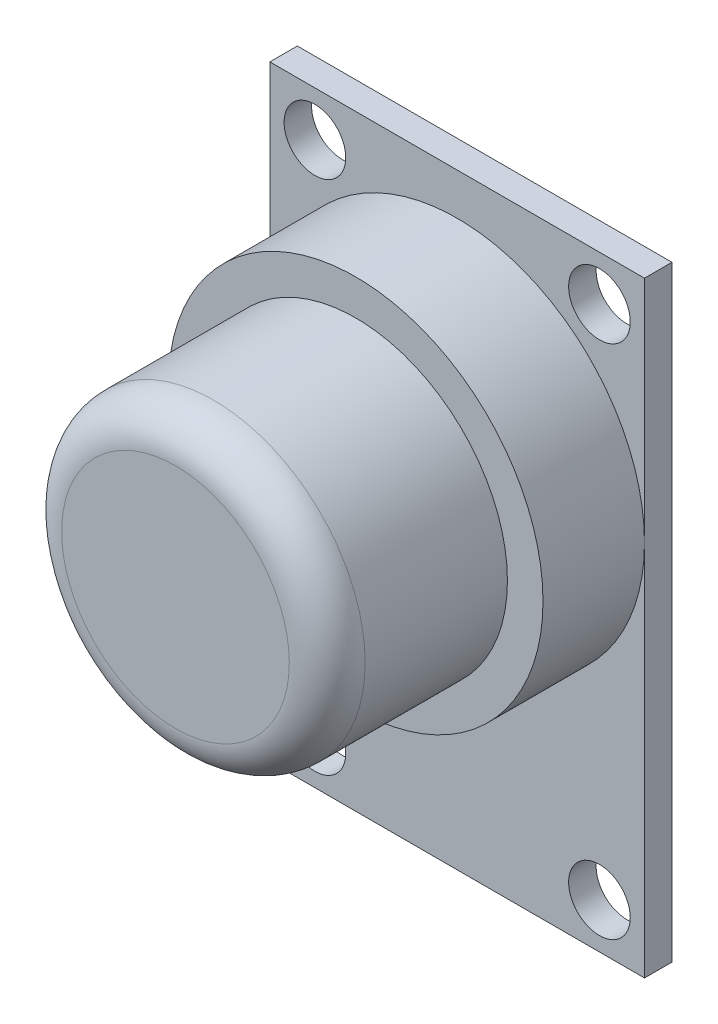
ISO-10303-21;
HEADER;
FILE_DESCRIPTION(('STEP AP214'),'2;1');
FILE_NAME('part.step','',(''),(''),'','','');
FILE_SCHEMA(('AUTOMOTIVE_DESIGN { 1 0 10303 214 1 1 1 1 }'));
ENDSEC;
DATA;
#1=APPLICATION_CONTEXT('core data for automotive mechanical design processes');
#2=APPLICATION_PROTOCOL_DEFINITION('international standard','automotive_design',2000,#1);
#3=PRODUCT_CONTEXT('',#1,'mechanical');
#4=PRODUCT('Part','Part','',(#3));
#5=PRODUCT_RELATED_PRODUCT_CATEGORY('part','',(#4));
#6=PRODUCT_DEFINITION_FORMATION('','',#4);
#7=PRODUCT_DEFINITION_CONTEXT('part definition',#1,'design');
#8=PRODUCT_DEFINITION('design','',#6,#7);
#9=PRODUCT_DEFINITION_SHAPE('','',#8);
#10=(LENGTH_UNIT() NAMED_UNIT(*) SI_UNIT(.MILLI.,.METRE.));
#11=(NAMED_UNIT(*) PLANE_ANGLE_UNIT() SI_UNIT($,.RADIAN.));
#12=(NAMED_UNIT(*) SI_UNIT($,.STERADIAN.) SOLID_ANGLE_UNIT());
#13=UNCERTAINTY_MEASURE_WITH_UNIT(LENGTH_MEASURE(1.E-05),#10,'distance_accuracy_value','');
#14=(GEOMETRIC_REPRESENTATION_CONTEXT(3) GLOBAL_UNCERTAINTY_ASSIGNED_CONTEXT((#13)) GLOBAL_UNIT_ASSIGNED_CONTEXT((#10,
#11,#12)) REPRESENTATION_CONTEXT('',''));
#15=CARTESIAN_POINT('',(0.,0.,0.));
#16=DIRECTION('',(0.,0.,1.));
#17=DIRECTION('',(1.,0.,0.));
#18=AXIS2_PLACEMENT_3D('',#15,#16,#17);
#19=CARTESIAN_POINT('',(0.,0.,1.45));
#20=DIRECTION('',(0.,0.,1.));
#21=DIRECTION('',(1.,0.,0.));
#22=AXIS2_PLACEMENT_3D('',#19,#20,#21);
#23=PLANE('',#22);
#24=CARTESIAN_POINT('',(0.,3.9,1.45));
#25=DIRECTION('',(0.,0.,1.));
#26=DIRECTION('',(1.,0.,0.));
#27=AXIS2_PLACEMENT_3D('',#24,#25,#26);
#28=CIRCLE('',#27,9.875);
#29=CARTESIAN_POINT('',(9.875,3.9,1.45));
#30=VERTEX_POINT('',#29);
#31=CARTESIAN_POINT('',(-9.875,3.9,1.45));
#32=VERTEX_POINT('',#31);
#33=EDGE_CURVE('E114',#30,#32,#28,.T.);
#34=ORIENTED_EDGE('',*,*,#33,.F.);
#35=DIRECTION('',(0.,1.,0.));
#36=VECTOR('',#35,1.);
#37=CARTESIAN_POINT('',(9.875,15.975,1.45));
#38=LINE('',#37,#36);
#39=CARTESIAN_POINT('',(9.875,15.975,1.45));
#40=VERTEX_POINT('',#39);
#41=EDGE_CURVE('E95',#30,#40,#38,.T.);
#42=ORIENTED_EDGE('',*,*,#41,.T.);
#43=DIRECTION('',(-1.,0.,0.));
#44=VECTOR('',#43,1.);
#45=CARTESIAN_POINT('',(-9.875,15.975,1.45));
#46=LINE('',#45,#44);
#47=CARTESIAN_POINT('',(-9.875,15.975,1.45));
#48=VERTEX_POINT('',#47);
#49=EDGE_CURVE('E104',#40,#48,#46,.T.);
#50=ORIENTED_EDGE('',*,*,#49,.T.);
#51=DIRECTION('',(0.,-1.,0.));
#52=VECTOR('',#51,1.);
#53=CARTESIAN_POINT('',(-9.875,15.975,1.45));
#54=LINE('',#53,#52);
#55=EDGE_CURVE('E117',#48,#32,#54,.T.);
#56=ORIENTED_EDGE('',*,*,#55,.T.);
#57=EDGE_LOOP('',(#34,#42,#50,#56));
#58=FACE_BOUND('',#57,.T.);
#59=CARTESIAN_POINT('',(-7.5,13.6,1.45));
#60=DIRECTION('',(0.,0.,1.));
#61=DIRECTION('',(1.,0.,0.));
#62=AXIS2_PLACEMENT_3D('',#59,#60,#61);
#63=CIRCLE('',#62,1.625);
#64=CARTESIAN_POINT('',(-5.875,13.6,1.45));
#65=VERTEX_POINT('',#64);
#66=EDGE_CURVE('E137',#65,#65,#63,.T.);
#67=ORIENTED_EDGE('',*,*,#66,.F.);
#68=EDGE_LOOP('',(#67));
#69=FACE_BOUND('',#68,.T.);
#70=CARTESIAN_POINT('',(7.5,13.6,1.45));
#71=DIRECTION('',(0.,0.,1.));
#72=DIRECTION('',(-1.,0.,0.));
#73=AXIS2_PLACEMENT_3D('',#70,#71,#72);
#74=CIRCLE('',#73,1.625);
#75=CARTESIAN_POINT('',(5.875,13.6,1.45));
#76=VERTEX_POINT('',#75);
#77=EDGE_CURVE('E150',#76,#76,#74,.T.);
#78=ORIENTED_EDGE('',*,*,#77,.F.);
#79=EDGE_LOOP('',(#78));
#80=FACE_BOUND('',#79,.T.);
#81=ADVANCED_FACE('F44',(#58,#69,#80),#23,.T.);
#82=CARTESIAN_POINT('',(9.875,15.975,1.45));
#83=DIRECTION('',(-1.,0.,0.));
#84=DIRECTION('',(0.,-1.,0.));
#85=AXIS2_PLACEMENT_3D('',#82,#83,#84);
#86=PLANE('',#85);
#87=DIRECTION('',(0.,1.,0.));
#88=VECTOR('',#87,1.);
#89=CARTESIAN_POINT('',(9.875,15.975,0.));
#90=LINE('',#89,#88);
#91=CARTESIAN_POINT('',(9.875,-15.975,0.));
#92=VERTEX_POINT('',#91);
#93=CARTESIAN_POINT('',(9.875,15.975,0.));
#94=VERTEX_POINT('',#93);
#95=EDGE_CURVE('E162',#92,#94,#90,.T.);
#96=ORIENTED_EDGE('',*,*,#95,.T.);
#97=DIRECTION('',(0.,0.,-1.));
#98=VECTOR('',#97,1.);
#99=CARTESIAN_POINT('',(9.875,15.975,1.45));
#100=LINE('',#99,#98);
#101=EDGE_CURVE('E110',#40,#94,#100,.T.);
#102=ORIENTED_EDGE('',*,*,#101,.F.);
#103=ORIENTED_EDGE('',*,*,#41,.F.);
#104=CARTESIAN_POINT('',(9.875,-15.975,1.45));
#105=VERTEX_POINT('',#104);
#106=EDGE_CURVE('E99',#105,#30,#38,.T.);
#107=ORIENTED_EDGE('',*,*,#106,.F.);
#108=DIRECTION('',(0.,0.,-1.));
#109=VECTOR('',#108,1.);
#110=CARTESIAN_POINT('',(9.875,-15.975,1.45));
#111=LINE('',#110,#109);
#112=EDGE_CURVE('E173',#105,#92,#111,.T.);
#113=ORIENTED_EDGE('',*,*,#112,.T.);
#114=EDGE_LOOP('',(#96,#102,#103,#107,#113));
#115=FACE_BOUND('',#114,.T.);
#116=ADVANCED_FACE('F108',(#115),#86,.F.);
#117=CARTESIAN_POINT('',(-9.875,15.975,1.45));
#118=DIRECTION('',(0.,-1.,0.));
#119=DIRECTION('',(0.,0.,-1.));
#120=AXIS2_PLACEMENT_3D('',#117,#118,#119);
#121=PLANE('',#120);
#122=DIRECTION('',(-1.,0.,0.));
#123=VECTOR('',#122,1.);
#124=CARTESIAN_POINT('',(-9.875,15.975,0.));
#125=LINE('',#124,#123);
#126=CARTESIAN_POINT('',(-9.875,15.975,0.));
#127=VERTEX_POINT('',#126);
#128=EDGE_CURVE('E176',#94,#127,#125,.T.);
#129=ORIENTED_EDGE('',*,*,#128,.T.);
#130=DIRECTION('',(0.,0.,-1.));
#131=VECTOR('',#130,1.);
#132=CARTESIAN_POINT('',(-9.875,15.975,1.45));
#133=LINE('',#132,#131);
#134=EDGE_CURVE('E129',#48,#127,#133,.T.);
#135=ORIENTED_EDGE('',*,*,#134,.F.);
#136=ORIENTED_EDGE('',*,*,#49,.F.);
#137=ORIENTED_EDGE('',*,*,#101,.T.);
#138=EDGE_LOOP('',(#129,#135,#136,#137));
#139=FACE_BOUND('',#138,.T.);
#140=ADVANCED_FACE('F210',(#139),#121,.F.);
#141=CARTESIAN_POINT('',(-9.875,15.975,1.45));
#142=DIRECTION('',(1.,0.,0.));
#143=DIRECTION('',(0.,1.,0.));
#144=AXIS2_PLACEMENT_3D('',#141,#142,#143);
#145=PLANE('',#144);
#146=DIRECTION('',(0.,-1.,0.));
#147=VECTOR('',#146,1.);
#148=CARTESIAN_POINT('',(-9.875,15.975,0.));
#149=LINE('',#148,#147);
#150=CARTESIAN_POINT('',(-9.875,-15.975,0.));
#151=VERTEX_POINT('',#150);
#152=EDGE_CURVE('E179',#127,#151,#149,.T.);
#153=ORIENTED_EDGE('',*,*,#152,.T.);
#154=DIRECTION('',(0.,0.,-1.));
#155=VECTOR('',#154,1.);
#156=CARTESIAN_POINT('',(-9.875,-15.975,1.45));
#157=LINE('',#156,#155);
#158=CARTESIAN_POINT('',(-9.875,-15.975,1.45));
#159=VERTEX_POINT('',#158);
#160=EDGE_CURVE('E186',#159,#151,#157,.T.);
#161=ORIENTED_EDGE('',*,*,#160,.F.);
#162=EDGE_CURVE('E168',#32,#159,#54,.T.);
#163=ORIENTED_EDGE('',*,*,#162,.F.);
#164=ORIENTED_EDGE('',*,*,#55,.F.);
#165=ORIENTED_EDGE('',*,*,#134,.T.);
#166=EDGE_LOOP('',(#153,#161,#163,#164,#165));
#167=FACE_BOUND('',#166,.T.);
#168=ADVANCED_FACE('F222',(#167),#145,.F.);
#169=CARTESIAN_POINT('',(-9.875,-15.975,1.45));
#170=DIRECTION('',(0.,1.,0.));
#171=DIRECTION('',(0.,0.,1.));
#172=AXIS2_PLACEMENT_3D('',#169,#170,#171);
#173=PLANE('',#172);
#174=DIRECTION('',(1.,0.,0.));
#175=VECTOR('',#174,1.);
#176=CARTESIAN_POINT('',(-9.875,-15.975,0.));
#177=LINE('',#176,#175);
#178=EDGE_CURVE('E87',#151,#92,#177,.T.);
#179=ORIENTED_EDGE('',*,*,#178,.T.);
#180=ORIENTED_EDGE('',*,*,#112,.F.);
#181=DIRECTION('',(1.,0.,0.));
#182=VECTOR('',#181,1.);
#183=CARTESIAN_POINT('',(-9.875,-15.975,1.45));
#184=LINE('',#183,#182);
#185=EDGE_CURVE('E66',#159,#105,#184,.T.);
#186=ORIENTED_EDGE('',*,*,#185,.F.);
#187=ORIENTED_EDGE('',*,*,#160,.T.);
#188=EDGE_LOOP('',(#179,#180,#186,#187));
#189=FACE_BOUND('',#188,.T.);
#190=ADVANCED_FACE('F215',(#189),#173,.F.);
#191=EDGE_CURVE('E60',#32,#30,#28,.T.);
#192=ORIENTED_EDGE('',*,*,#191,.F.);
#193=ORIENTED_EDGE('',*,*,#162,.T.);
#194=ORIENTED_EDGE('',*,*,#185,.T.);
#195=ORIENTED_EDGE('',*,*,#106,.T.);
#196=EDGE_LOOP('',(#192,#193,#194,#195));
#197=FACE_BOUND('',#196,.T.);
#198=CARTESIAN_POINT('',(7.5,-13.6,1.45));
#199=DIRECTION('',(0.,0.,1.));
#200=DIRECTION('',(1.,0.,0.));
#201=AXIS2_PLACEMENT_3D('',#198,#199,#200);
#202=CIRCLE('',#201,1.625);
#203=CARTESIAN_POINT('',(9.125,-13.6,1.45));
#204=VERTEX_POINT('',#203);
#205=EDGE_CURVE('E142',#204,#204,#202,.T.);
#206=ORIENTED_EDGE('',*,*,#205,.F.);
#207=EDGE_LOOP('',(#206));
#208=FACE_BOUND('',#207,.T.);
#209=CARTESIAN_POINT('',(-7.5,-13.6,1.45));
#210=DIRECTION('',(0.,0.,1.));
#211=DIRECTION('',(-1.,0.,0.));
#212=AXIS2_PLACEMENT_3D('',#209,#210,#211);
#213=CIRCLE('',#212,1.625);
#214=CARTESIAN_POINT('',(-9.125,-13.6,1.45));
#215=VERTEX_POINT('',#214);
#216=EDGE_CURVE('E133',#215,#215,#213,.T.);
#217=ORIENTED_EDGE('',*,*,#216,.F.);
#218=EDGE_LOOP('',(#217));
#219=FACE_BOUND('',#218,.T.);
#220=ADVANCED_FACE('F100',(#197,#208,#219),#23,.T.);
#221=CARTESIAN_POINT('',(0.,0.,0.));
#222=DIRECTION('',(0.,0.,1.));
#223=DIRECTION('',(1.,0.,0.));
#224=AXIS2_PLACEMENT_3D('',#221,#222,#223);
#225=PLANE('',#224);
#226=CARTESIAN_POINT('',(7.5,13.6,0.));
#227=DIRECTION('',(0.,0.,1.));
#228=DIRECTION('',(-1.,0.,0.));
#229=AXIS2_PLACEMENT_3D('',#226,#227,#228);
#230=CIRCLE('',#229,1.625);
#231=CARTESIAN_POINT('',(5.875,13.6,0.));
#232=VERTEX_POINT('',#231);
#233=EDGE_CURVE('E154',#232,#232,#230,.T.);
#234=ORIENTED_EDGE('',*,*,#233,.T.);
#235=EDGE_LOOP('',(#234));
#236=FACE_BOUND('',#235,.T.);
#237=CARTESIAN_POINT('',(7.5,-13.6,0.));
#238=DIRECTION('',(0.,0.,1.));
#239=DIRECTION('',(1.,0.,0.));
#240=AXIS2_PLACEMENT_3D('',#237,#238,#239);
#241=CIRCLE('',#240,1.625);
#242=CARTESIAN_POINT('',(9.125,-13.6,0.));
#243=VERTEX_POINT('',#242);
#244=EDGE_CURVE('E146',#243,#243,#241,.T.);
#245=ORIENTED_EDGE('',*,*,#244,.T.);
#246=EDGE_LOOP('',(#245));
#247=FACE_BOUND('',#246,.T.);
#248=CARTESIAN_POINT('',(-7.5,-13.6,0.));
#249=DIRECTION('',(0.,0.,1.));
#250=DIRECTION('',(-1.,0.,0.));
#251=AXIS2_PLACEMENT_3D('',#248,#249,#250);
#252=CIRCLE('',#251,1.625);
#253=CARTESIAN_POINT('',(-9.125,-13.6,0.));
#254=VERTEX_POINT('',#253);
#255=EDGE_CURVE('E138',#254,#254,#252,.T.);
#256=ORIENTED_EDGE('',*,*,#255,.T.);
#257=EDGE_LOOP('',(#256));
#258=FACE_BOUND('',#257,.T.);
#259=CARTESIAN_POINT('',(-7.5,13.6,0.));
#260=DIRECTION('',(0.,0.,1.));
#261=DIRECTION('',(1.,0.,0.));
#262=AXIS2_PLACEMENT_3D('',#259,#260,#261);
#263=CIRCLE('',#262,1.625);
#264=CARTESIAN_POINT('',(-5.875,13.6,0.));
#265=VERTEX_POINT('',#264);
#266=EDGE_CURVE('E158',#265,#265,#263,.T.);
#267=ORIENTED_EDGE('',*,*,#266,.T.);
#268=EDGE_LOOP('',(#267));
#269=FACE_BOUND('',#268,.T.);
#270=ORIENTED_EDGE('',*,*,#95,.F.);
#271=ORIENTED_EDGE('',*,*,#178,.F.);
#272=ORIENTED_EDGE('',*,*,#152,.F.);
#273=ORIENTED_EDGE('',*,*,#128,.F.);
#274=EDGE_LOOP('',(#270,#271,#272,#273));
#275=FACE_BOUND('',#274,.T.);
#276=ADVANCED_FACE('F214',(#236,#247,#258,#269,#275),#225,.F.);
#277=CARTESIAN_POINT('',(-7.5,13.6,0.));
#278=DIRECTION('',(0.,0.,1.));
#279=DIRECTION('',(1.,0.,0.));
#280=AXIS2_PLACEMENT_3D('',#277,#278,#279);
#281=CYLINDRICAL_SURFACE('',#280,1.625);
#282=ORIENTED_EDGE('',*,*,#266,.F.);
#283=EDGE_LOOP('',(#282));
#284=FACE_BOUND('',#283,.T.);
#285=ORIENTED_EDGE('',*,*,#66,.T.);
#286=EDGE_LOOP('',(#285));
#287=FACE_BOUND('',#286,.T.);
#288=ADVANCED_FACE('F220',(#284,#287),#281,.F.);
#289=CARTESIAN_POINT('',(-7.5,-13.6,0.));
#290=DIRECTION('',(0.,0.,1.));
#291=DIRECTION('',(1.,0.,0.));
#292=AXIS2_PLACEMENT_3D('',#289,#290,#291);
#293=CYLINDRICAL_SURFACE('',#292,1.625);
#294=ORIENTED_EDGE('',*,*,#255,.F.);
#295=EDGE_LOOP('',(#294));
#296=FACE_BOUND('',#295,.T.);
#297=ORIENTED_EDGE('',*,*,#216,.T.);
#298=EDGE_LOOP('',(#297));
#299=FACE_BOUND('',#298,.T.);
#300=ADVANCED_FACE('F260',(#296,#299),#293,.F.);
#301=CARTESIAN_POINT('',(7.5,-13.6,0.));
#302=DIRECTION('',(0.,0.,1.));
#303=DIRECTION('',(1.,0.,0.));
#304=AXIS2_PLACEMENT_3D('',#301,#302,#303);
#305=CYLINDRICAL_SURFACE('',#304,1.625);
#306=ORIENTED_EDGE('',*,*,#244,.F.);
#307=EDGE_LOOP('',(#306));
#308=FACE_BOUND('',#307,.T.);
#309=ORIENTED_EDGE('',*,*,#205,.T.);
#310=EDGE_LOOP('',(#309));
#311=FACE_BOUND('',#310,.T.);
#312=ADVANCED_FACE('F255',(#308,#311),#305,.F.);
#313=CARTESIAN_POINT('',(7.5,13.6,0.));
#314=DIRECTION('',(0.,0.,1.));
#315=DIRECTION('',(1.,0.,0.));
#316=AXIS2_PLACEMENT_3D('',#313,#314,#315);
#317=CYLINDRICAL_SURFACE('',#316,1.625);
#318=ORIENTED_EDGE('',*,*,#233,.F.);
#319=EDGE_LOOP('',(#318));
#320=FACE_BOUND('',#319,.T.);
#321=ORIENTED_EDGE('',*,*,#77,.T.);
#322=EDGE_LOOP('',(#321));
#323=FACE_BOUND('',#322,.T.);
#324=ADVANCED_FACE('F247',(#320,#323),#317,.F.);
#325=CARTESIAN_POINT('',(0.,3.9,6.8));
#326=DIRECTION('',(0.,0.,-1.));
#327=DIRECTION('',(-1.,0.,0.));
#328=AXIS2_PLACEMENT_3D('',#325,#326,#327);
#329=CYLINDRICAL_SURFACE('',#328,9.875);
#330=CARTESIAN_POINT('',(0.,3.9,6.8));
#331=DIRECTION('',(0.,0.,1.));
#332=DIRECTION('',(1.,0.,0.));
#333=AXIS2_PLACEMENT_3D('',#330,#331,#332);
#334=CIRCLE('',#333,9.875);
#335=CARTESIAN_POINT('',(9.875,3.9,6.8));
#336=VERTEX_POINT('',#335);
#337=EDGE_CURVE('E120',#336,#336,#334,.T.);
#338=ORIENTED_EDGE('',*,*,#337,.F.);
#339=EDGE_LOOP('',(#338));
#340=FACE_BOUND('',#339,.T.);
#341=ORIENTED_EDGE('',*,*,#33,.T.);
#342=ORIENTED_EDGE('',*,*,#191,.T.);
#343=EDGE_LOOP('',(#341,#342));
#344=FACE_BOUND('',#343,.T.);
#345=ADVANCED_FACE('F122',(#340,#344),#329,.T.);
#346=CARTESIAN_POINT('',(0.,3.9,6.8));
#347=DIRECTION('',(0.,0.,1.));
#348=DIRECTION('',(1.,0.,0.));
#349=AXIS2_PLACEMENT_3D('',#346,#347,#348);
#350=PLANE('',#349);
#351=CARTESIAN_POINT('',(0.,3.9,6.8));
#352=DIRECTION('',(0.,0.,1.));
#353=DIRECTION('',(1.,0.,0.));
#354=AXIS2_PLACEMENT_3D('',#351,#352,#353);
#355=CIRCLE('',#354,8.);
#356=CARTESIAN_POINT('',(8.,3.9,6.8));
#357=VERTEX_POINT('',#356);
#358=EDGE_CURVE('E124',#357,#357,#355,.T.);
#359=ORIENTED_EDGE('',*,*,#358,.F.);
#360=EDGE_LOOP('',(#359));
#361=FACE_BOUND('',#360,.T.);
#362=ORIENTED_EDGE('',*,*,#337,.T.);
#363=EDGE_LOOP('',(#362));
#364=FACE_BOUND('',#363,.T.);
#365=ADVANCED_FACE('F244',(#361,#364),#350,.T.);
#366=CARTESIAN_POINT('',(0.,3.9,16.3));
#367=DIRECTION('',(0.,0.,-1.));
#368=DIRECTION('',(-1.,0.,0.));
#369=AXIS2_PLACEMENT_3D('',#366,#367,#368);
#370=CYLINDRICAL_SURFACE('',#369,8.);
#371=CARTESIAN_POINT('',(0.,3.9,14.3));
#372=DIRECTION('',(0.,0.,1.));
#373=DIRECTION('',(1.,0.,0.));
#374=AXIS2_PLACEMENT_3D('',#371,#372,#373);
#375=CIRCLE('',#374,8.);
#376=CARTESIAN_POINT('',(8.,3.9,14.3));
#377=VERTEX_POINT('',#376);
#378=EDGE_CURVE('E11',#377,#377,#375,.F.);
#379=ORIENTED_EDGE('',*,*,#378,.T.);
#380=EDGE_LOOP('',(#379));
#381=FACE_BOUND('',#380,.T.);
#382=ORIENTED_EDGE('',*,*,#358,.T.);
#383=EDGE_LOOP('',(#382));
#384=FACE_BOUND('',#383,.T.);
#385=ADVANCED_FACE('F202',(#381,#384),#370,.T.);
#386=CARTESIAN_POINT('',(0.,3.9,16.3));
#387=DIRECTION('',(0.,0.,1.));
#388=DIRECTION('',(1.,0.,0.));
#389=AXIS2_PLACEMENT_3D('',#386,#387,#388);
#390=PLANE('',#389);
#391=CARTESIAN_POINT('',(0.,3.9,16.3));
#392=DIRECTION('',(0.,0.,1.));
#393=DIRECTION('',(1.,0.,0.));
#394=AXIS2_PLACEMENT_3D('',#391,#392,#393);
#395=CIRCLE('',#394,6.);
#396=CARTESIAN_POINT('',(6.,3.9,16.3));
#397=VERTEX_POINT('',#396);
#398=EDGE_CURVE('E53',#397,#397,#395,.T.);
#399=ORIENTED_EDGE('',*,*,#398,.T.);
#400=EDGE_LOOP('',(#399));
#401=FACE_BOUND('',#400,.T.);
#402=ADVANCED_FACE('F195',(#401),#390,.T.);
#403=CARTESIAN_POINT('',(0.,3.9,14.3));
#404=DIRECTION('',(0.,0.,1.));
#405=DIRECTION('',(1.,0.,0.));
#406=AXIS2_PLACEMENT_3D('',#403,#404,#405);
#407=TOROIDAL_SURFACE('',#406,6.,2.);
#408=ORIENTED_EDGE('',*,*,#378,.F.);
#409=EDGE_LOOP('',(#408));
#410=FACE_BOUND('',#409,.T.);
#411=ORIENTED_EDGE('',*,*,#398,.F.);
#412=EDGE_LOOP('',(#411));
#413=FACE_BOUND('',#412,.T.);
#414=ADVANCED_FACE('F46',(#410,#413),#407,.T.);
#415=CLOSED_SHELL('',(#81,#116,#140,#168,#190,#220,#276,#288,#300,#312,#324,#345,#365,#385,#402,#414));
#416=MANIFOLD_SOLID_BREP('B2',#415);
#417=ADVANCED_BREP_SHAPE_REPRESENTATION('',(#18,#416),#14);
#418=SHAPE_DEFINITION_REPRESENTATION(#9,#417);
ENDSEC;
END-ISO-10303-21;
